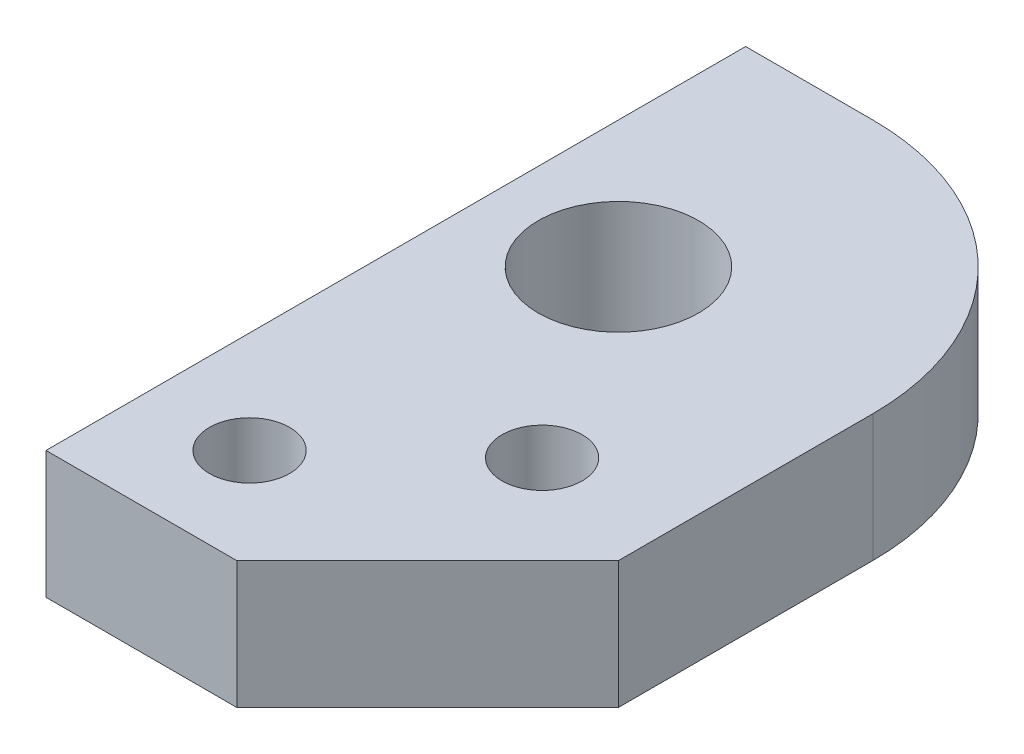
ISO-10303-21;
HEADER;
FILE_DESCRIPTION(('STEP AP214'),'2;1');
FILE_NAME('part.step','',(''),(''),'','','');
FILE_SCHEMA(('AUTOMOTIVE_DESIGN { 1 0 10303 214 1 1 1 1 }'));
ENDSEC;
DATA;
#1=APPLICATION_CONTEXT('core data for automotive mechanical design processes');
#2=APPLICATION_PROTOCOL_DEFINITION('international standard','automotive_design',2000,#1);
#3=PRODUCT_CONTEXT('',#1,'mechanical');
#4=PRODUCT('Part','Part','',(#3));
#5=PRODUCT_RELATED_PRODUCT_CATEGORY('part','',(#4));
#6=PRODUCT_DEFINITION_FORMATION('','',#4);
#7=PRODUCT_DEFINITION_CONTEXT('part definition',#1,'design');
#8=PRODUCT_DEFINITION('design','',#6,#7);
#9=PRODUCT_DEFINITION_SHAPE('','',#8);
#10=(LENGTH_UNIT() NAMED_UNIT(*) SI_UNIT(.MILLI.,.METRE.));
#11=(NAMED_UNIT(*) PLANE_ANGLE_UNIT() SI_UNIT($,.RADIAN.));
#12=(NAMED_UNIT(*) SI_UNIT($,.STERADIAN.) SOLID_ANGLE_UNIT());
#13=UNCERTAINTY_MEASURE_WITH_UNIT(LENGTH_MEASURE(1.E-05),#10,'distance_accuracy_value','');
#14=(GEOMETRIC_REPRESENTATION_CONTEXT(3) GLOBAL_UNCERTAINTY_ASSIGNED_CONTEXT((#13)) GLOBAL_UNIT_ASSIGNED_CONTEXT((#10,
#11,#12)) REPRESENTATION_CONTEXT('',''));
#15=CARTESIAN_POINT('',(0.,0.,0.));
#16=DIRECTION('',(0.,0.,1.));
#17=DIRECTION('',(1.,0.,0.));
#18=AXIS2_PLACEMENT_3D('',#15,#16,#17);
#19=CARTESIAN_POINT('',(12.7,6.35,-114.3));
#20=DIRECTION('',(0.,-1.,0.));
#21=DIRECTION('',(0.,0.,-1.));
#22=AXIS2_PLACEMENT_3D('',#19,#20,#21);
#23=CYLINDRICAL_SURFACE('',#22,12.7);
#24=CARTESIAN_POINT('',(12.7,0.,-114.3));
#25=DIRECTION('',(0.,1.,0.));
#26=DIRECTION('',(0.,0.,1.));
#27=AXIS2_PLACEMENT_3D('',#24,#25,#26);
#28=CIRCLE('',#27,12.7);
#29=CARTESIAN_POINT('',(12.6999999999999,0.,-127.));
#30=VERTEX_POINT('',#29);
#31=CARTESIAN_POINT('',(25.4,0.,-114.3));
#32=VERTEX_POINT('',#31);
#33=EDGE_CURVE('E127',#30,#32,#28,.F.);
#34=ORIENTED_EDGE('',*,*,#33,.F.);
#35=DIRECTION('',(0.,-1.,0.));
#36=VECTOR('',#35,1.);
#37=CARTESIAN_POINT('',(12.6999999999999,6.35,-127.));
#38=LINE('',#37,#36);
#39=CARTESIAN_POINT('',(12.6999999999999,6.35,-127.));
#40=VERTEX_POINT('',#39);
#41=EDGE_CURVE('E11',#40,#30,#38,.T.);
#42=ORIENTED_EDGE('',*,*,#41,.F.);
#43=CARTESIAN_POINT('',(12.7,6.35,-114.3));
#44=DIRECTION('',(0.,1.,0.));
#45=DIRECTION('',(0.,0.,1.));
#46=AXIS2_PLACEMENT_3D('',#43,#44,#45);
#47=CIRCLE('',#46,12.7);
#48=CARTESIAN_POINT('',(25.4,6.35,-114.3));
#49=VERTEX_POINT('',#48);
#50=EDGE_CURVE('E162',#40,#49,#47,.F.);
#51=ORIENTED_EDGE('',*,*,#50,.T.);
#52=DIRECTION('',(0.,-1.,0.));
#53=VECTOR('',#52,1.);
#54=CARTESIAN_POINT('',(25.4,6.35,-114.3));
#55=LINE('',#54,#53);
#56=EDGE_CURVE('E80',#49,#32,#55,.T.);
#57=ORIENTED_EDGE('',*,*,#56,.T.);
#58=EDGE_LOOP('',(#34,#42,#51,#57));
#59=FACE_BOUND('',#58,.T.);
#60=ADVANCED_FACE('F35',(#59),#23,.T.);
#61=CARTESIAN_POINT('',(0.,6.35,-127.));
#62=DIRECTION('',(0.,0.,-1.));
#63=DIRECTION('',(-1.,0.,0.));
#64=AXIS2_PLACEMENT_3D('',#61,#62,#63);
#65=PLANE('',#64);
#66=DIRECTION('',(1.,0.,0.));
#67=VECTOR('',#66,1.);
#68=CARTESIAN_POINT('',(0.,0.,-127.));
#69=LINE('',#68,#67);
#70=CARTESIAN_POINT('',(6.3499999999998,0.,-127.));
#71=VERTEX_POINT('',#70);
#72=EDGE_CURVE('E130',#71,#30,#69,.T.);
#73=ORIENTED_EDGE('',*,*,#72,.F.);
#74=DIRECTION('',(0.,-1.,0.));
#75=VECTOR('',#74,1.);
#76=CARTESIAN_POINT('',(6.3499999999998,6.35,-127.));
#77=LINE('',#76,#75);
#78=CARTESIAN_POINT('',(6.3499999999998,6.35,-127.));
#79=VERTEX_POINT('',#78);
#80=EDGE_CURVE('E44',#79,#71,#77,.T.);
#81=ORIENTED_EDGE('',*,*,#80,.F.);
#82=DIRECTION('',(1.,0.,0.));
#83=VECTOR('',#82,1.);
#84=CARTESIAN_POINT('',(0.,6.35,-127.));
#85=LINE('',#84,#83);
#86=EDGE_CURVE('E160',#79,#40,#85,.T.);
#87=ORIENTED_EDGE('',*,*,#86,.T.);
#88=ORIENTED_EDGE('',*,*,#41,.T.);
#89=EDGE_LOOP('',(#73,#81,#87,#88));
#90=FACE_BOUND('',#89,.T.);
#91=ADVANCED_FACE('F159',(#90),#65,.T.);
#92=CARTESIAN_POINT('',(6.3500000000005,6.35,0.));
#93=DIRECTION('',(1.,0.,0.));
#94=DIRECTION('',(0.,0.,-1.));
#95=AXIS2_PLACEMENT_3D('',#92,#93,#94);
#96=PLANE('',#95);
#97=DIRECTION('',(0.,0.,1.));
#98=VECTOR('',#97,1.);
#99=CARTESIAN_POINT('',(6.3500000000005,0.,0.));
#100=LINE('',#99,#98);
#101=CARTESIAN_POINT('',(6.34999999999996,0.,-92.0749999999997));
#102=VERTEX_POINT('',#101);
#103=EDGE_CURVE('E133',#71,#102,#100,.T.);
#104=ORIENTED_EDGE('',*,*,#103,.T.);
#105=DIRECTION('',(0.,-1.,0.));
#106=VECTOR('',#105,1.);
#107=CARTESIAN_POINT('',(6.34999999999996,6.35,-92.0749999999997));
#108=LINE('',#107,#106);
#109=CARTESIAN_POINT('',(6.34999999999996,6.35,-92.0749999999997));
#110=VERTEX_POINT('',#109);
#111=EDGE_CURVE('E111',#110,#102,#108,.T.);
#112=ORIENTED_EDGE('',*,*,#111,.F.);
#113=DIRECTION('',(0.,0.,1.));
#114=VECTOR('',#113,1.);
#115=CARTESIAN_POINT('',(6.3500000000005,6.35,0.));
#116=LINE('',#115,#114);
#117=EDGE_CURVE('E99',#79,#110,#116,.T.);
#118=ORIENTED_EDGE('',*,*,#117,.F.);
#119=ORIENTED_EDGE('',*,*,#80,.T.);
#120=EDGE_LOOP('',(#104,#112,#118,#119));
#121=FACE_BOUND('',#120,.T.);
#122=ADVANCED_FACE('F152',(#121),#96,.F.);
#123=CARTESIAN_POINT('',(-1.34151948808872E-13,6.35,-92.0749999999997));
#124=DIRECTION('',(0.,0.,-1.));
#125=DIRECTION('',(-1.,0.,0.));
#126=AXIS2_PLACEMENT_3D('',#123,#124,#125);
#127=PLANE('',#126);
#128=DIRECTION('',(1.,0.,0.));
#129=VECTOR('',#128,1.);
#130=CARTESIAN_POINT('',(-1.34151948808872E-13,0.,-92.0749999999997));
#131=LINE('',#130,#129);
#132=CARTESIAN_POINT('',(15.875,0.,-92.0749999999998));
#133=VERTEX_POINT('',#132);
#134=EDGE_CURVE('E107',#102,#133,#131,.T.);
#135=ORIENTED_EDGE('',*,*,#134,.T.);
#136=DIRECTION('',(0.,-1.,0.));
#137=VECTOR('',#136,1.);
#138=CARTESIAN_POINT('',(15.875,6.35,-92.0749999999998));
#139=LINE('',#138,#137);
#140=CARTESIAN_POINT('',(15.875,6.35,-92.0749999999998));
#141=VERTEX_POINT('',#140);
#142=EDGE_CURVE('E105',#141,#133,#139,.T.);
#143=ORIENTED_EDGE('',*,*,#142,.F.);
#144=DIRECTION('',(1.,0.,0.));
#145=VECTOR('',#144,1.);
#146=CARTESIAN_POINT('',(-1.34151948808872E-13,6.35,-92.0749999999997));
#147=LINE('',#146,#145);
#148=EDGE_CURVE('E91',#110,#141,#147,.T.);
#149=ORIENTED_EDGE('',*,*,#148,.F.);
#150=ORIENTED_EDGE('',*,*,#111,.T.);
#151=EDGE_LOOP('',(#135,#143,#149,#150));
#152=FACE_BOUND('',#151,.T.);
#153=ADVANCED_FACE('F106',(#152),#127,.F.);
#154=CARTESIAN_POINT('',(-38.0999999999997,6.35,-38.0999999999987));
#155=DIRECTION('',(0.707106781186556,0.,0.707106781186539));
#156=DIRECTION('',(0.707106781186539,0.,-0.707106781186556));
#157=AXIS2_PLACEMENT_3D('',#154,#155,#156);
#158=PLANE('',#157);
#159=DIRECTION('',(-0.707106781186539,0.,0.707106781186556));
#160=VECTOR('',#159,1.);
#161=CARTESIAN_POINT('',(-38.0999999999997,0.,-38.0999999999987));
#162=LINE('',#161,#160);
#163=CARTESIAN_POINT('',(25.4,0.,-101.6));
#164=VERTEX_POINT('',#163);
#165=EDGE_CURVE('E137',#164,#133,#162,.T.);
#166=ORIENTED_EDGE('',*,*,#165,.F.);
#167=DIRECTION('',(0.,-1.,0.));
#168=VECTOR('',#167,1.);
#169=CARTESIAN_POINT('',(25.4,6.35,-101.6));
#170=LINE('',#169,#168);
#171=CARTESIAN_POINT('',(25.4,6.35,-101.6));
#172=VERTEX_POINT('',#171);
#173=EDGE_CURVE('E73',#172,#164,#170,.T.);
#174=ORIENTED_EDGE('',*,*,#173,.F.);
#175=DIRECTION('',(-0.707106781186539,0.,0.707106781186556));
#176=VECTOR('',#175,1.);
#177=CARTESIAN_POINT('',(-38.0999999999997,6.35,-38.0999999999987));
#178=LINE('',#177,#176);
#179=EDGE_CURVE('E96',#172,#141,#178,.T.);
#180=ORIENTED_EDGE('',*,*,#179,.T.);
#181=ORIENTED_EDGE('',*,*,#142,.T.);
#182=EDGE_LOOP('',(#166,#174,#180,#181));
#183=FACE_BOUND('',#182,.T.);
#184=ADVANCED_FACE('F113',(#183),#158,.T.);
#185=CARTESIAN_POINT('',(19.0499999999999,6.35,-104.14));
#186=DIRECTION('',(0.,-1.,0.));
#187=DIRECTION('',(0.,0.,-1.));
#188=AXIS2_PLACEMENT_3D('',#185,#186,#187);
#189=CYLINDRICAL_SURFACE('',#188,2.);
#190=CARTESIAN_POINT('',(19.0499999999999,6.35,-104.14));
#191=DIRECTION('',(0.,1.,0.));
#192=DIRECTION('',(0.,0.,1.));
#193=AXIS2_PLACEMENT_3D('',#190,#191,#192);
#194=CIRCLE('',#193,2.);
#195=CARTESIAN_POINT('',(19.0499999999999,6.35,-102.14));
#196=VERTEX_POINT('',#195);
#197=EDGE_CURVE('E115',#196,#196,#194,.T.);
#198=ORIENTED_EDGE('',*,*,#197,.T.);
#199=EDGE_LOOP('',(#198));
#200=FACE_BOUND('',#199,.T.);
#201=CARTESIAN_POINT('',(19.0499999999999,0.,-104.14));
#202=DIRECTION('',(0.,1.,0.));
#203=DIRECTION('',(0.,0.,1.));
#204=AXIS2_PLACEMENT_3D('',#201,#202,#203);
#205=CIRCLE('',#204,2.);
#206=CARTESIAN_POINT('',(19.0499999999999,0.,-102.14));
#207=VERTEX_POINT('',#206);
#208=EDGE_CURVE('E141',#207,#207,#205,.T.);
#209=ORIENTED_EDGE('',*,*,#208,.F.);
#210=EDGE_LOOP('',(#209));
#211=FACE_BOUND('',#210,.T.);
#212=ADVANCED_FACE('F194',(#200,#211),#189,.F.);
#213=CARTESIAN_POINT('',(25.4,6.35,0.));
#214=DIRECTION('',(-1.,0.,0.));
#215=DIRECTION('',(0.,0.,1.));
#216=AXIS2_PLACEMENT_3D('',#213,#214,#215);
#217=PLANE('',#216);
#218=DIRECTION('',(0.,0.,-1.));
#219=VECTOR('',#218,1.);
#220=CARTESIAN_POINT('',(25.4,0.,0.));
#221=LINE('',#220,#219);
#222=EDGE_CURVE('E139',#164,#32,#221,.T.);
#223=ORIENTED_EDGE('',*,*,#222,.T.);
#224=ORIENTED_EDGE('',*,*,#56,.F.);
#225=DIRECTION('',(0.,0.,-1.));
#226=VECTOR('',#225,1.);
#227=CARTESIAN_POINT('',(25.4,6.35,0.));
#228=LINE('',#227,#226);
#229=EDGE_CURVE('E52',#172,#49,#228,.T.);
#230=ORIENTED_EDGE('',*,*,#229,.F.);
#231=ORIENTED_EDGE('',*,*,#173,.T.);
#232=EDGE_LOOP('',(#223,#224,#230,#231));
#233=FACE_BOUND('',#232,.T.);
#234=ADVANCED_FACE('F161',(#233),#217,.F.);
#235=CARTESIAN_POINT('',(12.7,6.35,-114.3));
#236=DIRECTION('',(0.,-1.,0.));
#237=DIRECTION('',(0.,0.,-1.));
#238=AXIS2_PLACEMENT_3D('',#235,#236,#237);
#239=CYLINDRICAL_SURFACE('',#238,4.0005);
#240=CARTESIAN_POINT('',(12.7,6.35,-114.3));
#241=DIRECTION('',(0.,1.,0.));
#242=DIRECTION('',(0.,0.,1.));
#243=AXIS2_PLACEMENT_3D('',#240,#241,#242);
#244=CIRCLE('',#243,4.0005);
#245=CARTESIAN_POINT('',(12.7,6.35,-110.2995));
#246=VERTEX_POINT('',#245);
#247=EDGE_CURVE('E147',#246,#246,#244,.T.);
#248=ORIENTED_EDGE('',*,*,#247,.T.);
#249=EDGE_LOOP('',(#248));
#250=FACE_BOUND('',#249,.T.);
#251=CARTESIAN_POINT('',(12.7,0.,-114.3));
#252=DIRECTION('',(0.,1.,0.));
#253=DIRECTION('',(0.,0.,1.));
#254=AXIS2_PLACEMENT_3D('',#251,#252,#253);
#255=CIRCLE('',#254,4.0005);
#256=CARTESIAN_POINT('',(12.7,0.,-110.2995));
#257=VERTEX_POINT('',#256);
#258=EDGE_CURVE('E124',#257,#257,#255,.T.);
#259=ORIENTED_EDGE('',*,*,#258,.F.);
#260=EDGE_LOOP('',(#259));
#261=FACE_BOUND('',#260,.T.);
#262=ADVANCED_FACE('F37',(#250,#261),#239,.F.);
#263=CARTESIAN_POINT('',(11.4299999999998,6.35,-97.1549999999999));
#264=DIRECTION('',(0.,-1.,0.));
#265=DIRECTION('',(0.,0.,-1.));
#266=AXIS2_PLACEMENT_3D('',#263,#264,#265);
#267=CYLINDRICAL_SURFACE('',#266,2.);
#268=CARTESIAN_POINT('',(11.4299999999998,6.35,-97.1549999999999));
#269=DIRECTION('',(0.,1.,0.));
#270=DIRECTION('',(0.,0.,1.));
#271=AXIS2_PLACEMENT_3D('',#268,#269,#270);
#272=CIRCLE('',#271,2.);
#273=CARTESIAN_POINT('',(11.4299999999998,6.35,-95.1549999999999));
#274=VERTEX_POINT('',#273);
#275=EDGE_CURVE('E121',#274,#274,#272,.T.);
#276=ORIENTED_EDGE('',*,*,#275,.T.);
#277=EDGE_LOOP('',(#276));
#278=FACE_BOUND('',#277,.T.);
#279=CARTESIAN_POINT('',(11.4299999999998,0.,-97.1549999999999));
#280=DIRECTION('',(0.,1.,0.));
#281=DIRECTION('',(0.,0.,1.));
#282=AXIS2_PLACEMENT_3D('',#279,#280,#281);
#283=CIRCLE('',#282,2.);
#284=CARTESIAN_POINT('',(11.4299999999998,0.,-95.1549999999999));
#285=VERTEX_POINT('',#284);
#286=EDGE_CURVE('E144',#285,#285,#283,.T.);
#287=ORIENTED_EDGE('',*,*,#286,.F.);
#288=EDGE_LOOP('',(#287));
#289=FACE_BOUND('',#288,.T.);
#290=ADVANCED_FACE('F172',(#278,#289),#267,.F.);
#291=CARTESIAN_POINT('',(0.,6.35,0.));
#292=DIRECTION('',(0.,1.,0.));
#293=DIRECTION('',(0.,0.,1.));
#294=AXIS2_PLACEMENT_3D('',#291,#292,#293);
#295=PLANE('',#294);
#296=ORIENTED_EDGE('',*,*,#247,.F.);
#297=EDGE_LOOP('',(#296));
#298=FACE_BOUND('',#297,.T.);
#299=ORIENTED_EDGE('',*,*,#50,.F.);
#300=ORIENTED_EDGE('',*,*,#86,.F.);
#301=ORIENTED_EDGE('',*,*,#117,.T.);
#302=ORIENTED_EDGE('',*,*,#148,.T.);
#303=ORIENTED_EDGE('',*,*,#179,.F.);
#304=ORIENTED_EDGE('',*,*,#229,.T.);
#305=EDGE_LOOP('',(#299,#300,#301,#302,#303,#304));
#306=FACE_BOUND('',#305,.T.);
#307=ORIENTED_EDGE('',*,*,#197,.F.);
#308=EDGE_LOOP('',(#307));
#309=FACE_BOUND('',#308,.T.);
#310=ORIENTED_EDGE('',*,*,#275,.F.);
#311=EDGE_LOOP('',(#310));
#312=FACE_BOUND('',#311,.T.);
#313=ADVANCED_FACE('F93',(#298,#306,#309,#312),#295,.T.);
#314=CARTESIAN_POINT('',(0.,0.,0.));
#315=DIRECTION('',(0.,1.,0.));
#316=DIRECTION('',(0.,0.,1.));
#317=AXIS2_PLACEMENT_3D('',#314,#315,#316);
#318=PLANE('',#317);
#319=ORIENTED_EDGE('',*,*,#258,.T.);
#320=EDGE_LOOP('',(#319));
#321=FACE_BOUND('',#320,.T.);
#322=ORIENTED_EDGE('',*,*,#33,.T.);
#323=ORIENTED_EDGE('',*,*,#222,.F.);
#324=ORIENTED_EDGE('',*,*,#165,.T.);
#325=ORIENTED_EDGE('',*,*,#134,.F.);
#326=ORIENTED_EDGE('',*,*,#103,.F.);
#327=ORIENTED_EDGE('',*,*,#72,.T.);
#328=EDGE_LOOP('',(#322,#323,#324,#325,#326,#327));
#329=FACE_BOUND('',#328,.T.);
#330=ORIENTED_EDGE('',*,*,#208,.T.);
#331=EDGE_LOOP('',(#330));
#332=FACE_BOUND('',#331,.T.);
#333=ORIENTED_EDGE('',*,*,#286,.T.);
#334=EDGE_LOOP('',(#333));
#335=FACE_BOUND('',#334,.T.);
#336=ADVANCED_FACE('F157',(#321,#329,#332,#335),#318,.F.);
#337=CLOSED_SHELL('',(#60,#91,#122,#153,#184,#212,#234,#262,#290,#313,#336));
#338=MANIFOLD_SOLID_BREP('B2',#337);
#339=ADVANCED_BREP_SHAPE_REPRESENTATION('',(#18,#338),#14);
#340=SHAPE_DEFINITION_REPRESENTATION(#9,#339);
ENDSEC;
END-ISO-10303-21;
